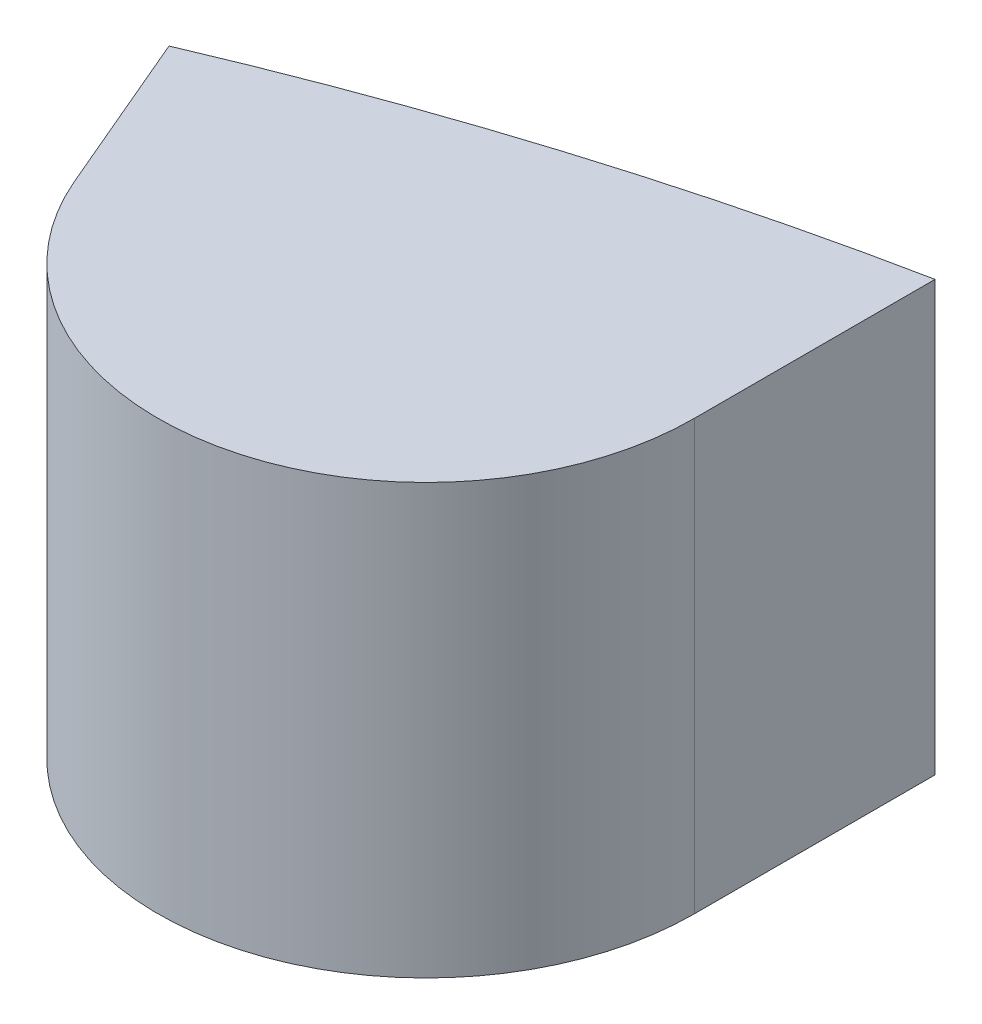
ISO-10303-21;
HEADER;
FILE_DESCRIPTION(('STEP AP214'),'2;1');
FILE_NAME('part.step','',(''),(''),'','','');
FILE_SCHEMA(('AUTOMOTIVE_DESIGN { 1 0 10303 214 1 1 1 1 }'));
ENDSEC;
DATA;
#1=APPLICATION_CONTEXT('core data for automotive mechanical design processes');
#2=APPLICATION_PROTOCOL_DEFINITION('international standard','automotive_design',2000,#1);
#3=PRODUCT_CONTEXT('',#1,'mechanical');
#4=PRODUCT('Part','Part','',(#3));
#5=PRODUCT_RELATED_PRODUCT_CATEGORY('part','',(#4));
#6=PRODUCT_DEFINITION_FORMATION('','',#4);
#7=PRODUCT_DEFINITION_CONTEXT('part definition',#1,'design');
#8=PRODUCT_DEFINITION('design','',#6,#7);
#9=PRODUCT_DEFINITION_SHAPE('','',#8);
#10=(LENGTH_UNIT() NAMED_UNIT(*) SI_UNIT(.MILLI.,.METRE.));
#11=(NAMED_UNIT(*) PLANE_ANGLE_UNIT() SI_UNIT($,.RADIAN.));
#12=(NAMED_UNIT(*) SI_UNIT($,.STERADIAN.) SOLID_ANGLE_UNIT());
#13=UNCERTAINTY_MEASURE_WITH_UNIT(LENGTH_MEASURE(1.E-05),#10,'distance_accuracy_value','');
#14=(GEOMETRIC_REPRESENTATION_CONTEXT(3) GLOBAL_UNCERTAINTY_ASSIGNED_CONTEXT((#13)) GLOBAL_UNIT_ASSIGNED_CONTEXT((#10,
#11,#12)) REPRESENTATION_CONTEXT('',''));
#15=CARTESIAN_POINT('',(0.,0.,0.));
#16=DIRECTION('',(0.,0.,1.));
#17=DIRECTION('',(1.,0.,0.));
#18=AXIS2_PLACEMENT_3D('',#15,#16,#17);
#19=CARTESIAN_POINT('',(0.,3.468427124746,0.));
#20=DIRECTION('',(0.,-1.,0.));
#21=DIRECTION('',(0.,0.,-1.));
#22=AXIS2_PLACEMENT_3D('',#19,#20,#21);
#23=CYLINDRICAL_SURFACE('',#22,4.445);
#24=CARTESIAN_POINT('',(0.,0.,0.));
#25=DIRECTION('',(0.,-1.,0.));
#26=DIRECTION('',(0.,0.,-1.));
#27=AXIS2_PLACEMENT_3D('',#24,#25,#26);
#28=CIRCLE('',#27,4.445);
#29=CARTESIAN_POINT('',(-0.87,0.,-4.3590279879809));
#30=VERTEX_POINT('',#29);
#31=CARTESIAN_POINT('',(-1.74264312419415,0.,-4.08915883057876));
#32=VERTEX_POINT('',#31);
#33=EDGE_CURVE('E74',#30,#32,#28,.F.);
#34=ORIENTED_EDGE('',*,*,#33,.T.);
#35=DIRECTION('',(0.,1.,0.));
#36=VECTOR('',#35,1.);
#37=CARTESIAN_POINT('',(-1.74264312419443,3.468427124746,-4.08915883057882));
#38=LINE('',#37,#36);
#39=CARTESIAN_POINT('',(-1.74264312419436,0.64,-4.08915883057867));
#40=VERTEX_POINT('',#39);
#41=EDGE_CURVE('E60',#32,#40,#38,.T.);
#42=ORIENTED_EDGE('',*,*,#41,.T.);
#43=CARTESIAN_POINT('',(0.,0.64,0.));
#44=DIRECTION('',(0.,-1.,0.));
#45=DIRECTION('',(0.,0.,-1.));
#46=AXIS2_PLACEMENT_3D('',#43,#44,#45);
#47=CIRCLE('',#46,4.445);
#48=CARTESIAN_POINT('',(-0.87,0.64,-4.3590279879809));
#49=VERTEX_POINT('',#48);
#50=EDGE_CURVE('E20',#49,#40,#47,.F.);
#51=ORIENTED_EDGE('',*,*,#50,.F.);
#52=DIRECTION('',(0.,1.,0.));
#53=VECTOR('',#52,1.);
#54=CARTESIAN_POINT('',(-0.87,3.468427124746,-4.359027987981));
#55=LINE('',#54,#53);
#56=EDGE_CURVE('E58',#49,#30,#55,.F.);
#57=ORIENTED_EDGE('',*,*,#56,.T.);
#58=EDGE_LOOP('',(#34,#42,#51,#57));
#59=FACE_BOUND('',#58,.T.);
#60=ADVANCED_FACE('F17',(#59),#23,.T.);
#61=CARTESIAN_POINT('',(0.,0.64,0.));
#62=DIRECTION('',(0.,1.,0.));
#63=DIRECTION('',(0.,0.,1.));
#64=AXIS2_PLACEMENT_3D('',#61,#62,#63);
#65=PLANE('',#64);
#66=DIRECTION('',(0.,0.,1.));
#67=VECTOR('',#66,1.);
#68=CARTESIAN_POINT('',(-0.87,0.64,-4.));
#69=LINE('',#68,#67);
#70=CARTESIAN_POINT('',(-0.87,0.64,-4.));
#71=VERTEX_POINT('',#70);
#72=EDGE_CURVE('E64',#71,#49,#69,.F.);
#73=ORIENTED_EDGE('',*,*,#72,.T.);
#74=ORIENTED_EDGE('',*,*,#50,.T.);
#75=DIRECTION('',(-0.391535049505804,0.,-0.92016319476954));
#76=VECTOR('',#75,1.);
#77=CARTESIAN_POINT('',(-1.638065277908,0.64,-3.843385980198));
#78=LINE('',#77,#76);
#79=CARTESIAN_POINT('',(-1.63806527790791,0.64,-3.84338598019784));
#80=VERTEX_POINT('',#79);
#81=EDGE_CURVE('E79',#40,#80,#78,.F.);
#82=ORIENTED_EDGE('',*,*,#81,.T.);
#83=CARTESIAN_POINT('',(-1.27,0.64,-4.));
#84=DIRECTION('',(0.,-1.,0.));
#85=DIRECTION('',(0.,0.,-1.));
#86=AXIS2_PLACEMENT_3D('',#83,#84,#85);
#87=CIRCLE('',#86,0.4);
#88=EDGE_CURVE('E67',#71,#80,#87,.T.);
#89=ORIENTED_EDGE('',*,*,#88,.F.);
#90=EDGE_LOOP('',(#73,#74,#82,#89));
#91=FACE_BOUND('',#90,.T.);
#92=ADVANCED_FACE('F65',(#91),#65,.T.);
#93=CARTESIAN_POINT('',(-1.638065277908,3.468427124746,-3.843385980198));
#94=DIRECTION('',(0.92016319476954,0.,-0.391535049505804));
#95=DIRECTION('',(-0.391535049505804,0.,-0.92016319476954));
#96=AXIS2_PLACEMENT_3D('',#93,#94,#95);
#97=PLANE('',#96);
#98=ORIENTED_EDGE('',*,*,#41,.F.);
#99=DIRECTION('',(0.391535049504207,0.,0.92016319477022));
#100=VECTOR('',#99,1.);
#101=CARTESIAN_POINT('',(-1.742643124194,0.,-4.089158830579));
#102=LINE('',#101,#100);
#103=CARTESIAN_POINT('',(-1.63806527790804,0.,-3.84338598019816));
#104=VERTEX_POINT('',#103);
#105=EDGE_CURVE('E71',#32,#104,#102,.T.);
#106=ORIENTED_EDGE('',*,*,#105,.T.);
#107=DIRECTION('',(0.,-1.,0.));
#108=VECTOR('',#107,1.);
#109=CARTESIAN_POINT('',(-1.63806527790796,3.468427124746,-3.84338598019802));
#110=LINE('',#109,#108);
#111=EDGE_CURVE('E82',#80,#104,#110,.T.);
#112=ORIENTED_EDGE('',*,*,#111,.F.);
#113=ORIENTED_EDGE('',*,*,#81,.F.);
#114=EDGE_LOOP('',(#98,#106,#112,#113));
#115=FACE_BOUND('',#114,.T.);
#116=ADVANCED_FACE('F89',(#115),#97,.F.);
#117=CARTESIAN_POINT('',(-1.27,0.,-4.));
#118=DIRECTION('',(0.,1.,0.));
#119=DIRECTION('',(0.,0.,1.));
#120=AXIS2_PLACEMENT_3D('',#117,#118,#119);
#121=PLANE('',#120);
#122=ORIENTED_EDGE('',*,*,#105,.F.);
#123=ORIENTED_EDGE('',*,*,#33,.F.);
#124=DIRECTION('',(0.,0.,1.));
#125=VECTOR('',#124,1.);
#126=CARTESIAN_POINT('',(-0.87,0.,-4.));
#127=LINE('',#126,#125);
#128=CARTESIAN_POINT('',(-0.87,0.,-4.));
#129=VERTEX_POINT('',#128);
#130=EDGE_CURVE('E35',#30,#129,#127,.T.);
#131=ORIENTED_EDGE('',*,*,#130,.T.);
#132=CARTESIAN_POINT('',(-1.27,0.,-4.));
#133=DIRECTION('',(0.,-1.,0.));
#134=DIRECTION('',(0.,0.,-1.));
#135=AXIS2_PLACEMENT_3D('',#132,#133,#134);
#136=CIRCLE('',#135,0.4);
#137=EDGE_CURVE('E26',#104,#129,#136,.F.);
#138=ORIENTED_EDGE('',*,*,#137,.F.);
#139=EDGE_LOOP('',(#122,#123,#131,#138));
#140=FACE_BOUND('',#139,.T.);
#141=ADVANCED_FACE('F91',(#140),#121,.F.);
#142=CARTESIAN_POINT('',(-0.87,3.468427124746,-4.));
#143=DIRECTION('',(-1.,0.,0.));
#144=DIRECTION('',(0.,0.,1.));
#145=AXIS2_PLACEMENT_3D('',#142,#143,#144);
#146=PLANE('',#145);
#147=DIRECTION('',(0.,-1.,0.));
#148=VECTOR('',#147,1.);
#149=CARTESIAN_POINT('',(-0.87,3.468427124746,-4.));
#150=LINE('',#149,#148);
#151=EDGE_CURVE('E11',#129,#71,#150,.F.);
#152=ORIENTED_EDGE('',*,*,#151,.F.);
#153=ORIENTED_EDGE('',*,*,#130,.F.);
#154=ORIENTED_EDGE('',*,*,#56,.F.);
#155=ORIENTED_EDGE('',*,*,#72,.F.);
#156=EDGE_LOOP('',(#152,#153,#154,#155));
#157=FACE_BOUND('',#156,.T.);
#158=ADVANCED_FACE('F70',(#157),#146,.F.);
#159=CARTESIAN_POINT('',(-1.27,3.468427124746,-4.));
#160=DIRECTION('',(0.,-1.,0.));
#161=DIRECTION('',(0.,0.,-1.));
#162=AXIS2_PLACEMENT_3D('',#159,#160,#161);
#163=CYLINDRICAL_SURFACE('',#162,0.4);
#164=ORIENTED_EDGE('',*,*,#137,.T.);
#165=ORIENTED_EDGE('',*,*,#151,.T.);
#166=ORIENTED_EDGE('',*,*,#88,.T.);
#167=ORIENTED_EDGE('',*,*,#111,.T.);
#168=EDGE_LOOP('',(#164,#165,#166,#167));
#169=FACE_BOUND('',#168,.T.);
#170=ADVANCED_FACE('F87',(#169),#163,.T.);
#171=CLOSED_SHELL('',(#60,#92,#116,#141,#158,#170));
#172=MANIFOLD_SOLID_BREP('B1',#171);
#173=ADVANCED_BREP_SHAPE_REPRESENTATION('',(#18,#172),#14);
#174=SHAPE_DEFINITION_REPRESENTATION(#9,#173);
ENDSEC;
END-ISO-10303-21;
